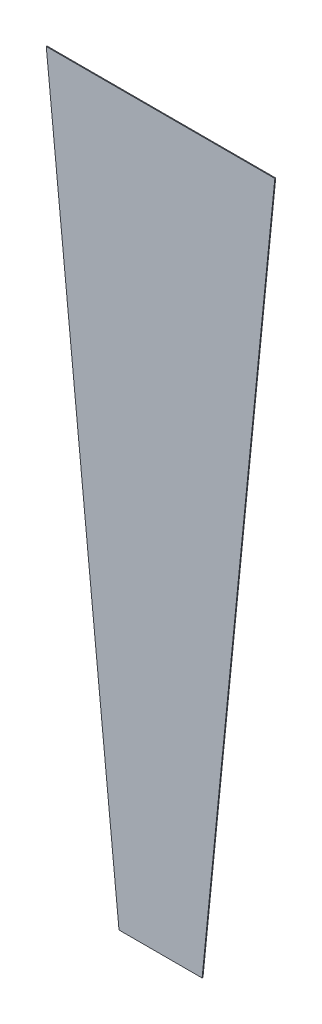
ISO-10303-21;
HEADER;
FILE_DESCRIPTION(('STEP AP214'),'2;1');
FILE_NAME('part.step','',(''),(''),'','','');
FILE_SCHEMA(('AUTOMOTIVE_DESIGN { 1 0 10303 214 1 1 1 1 }'));
ENDSEC;
DATA;
#1=APPLICATION_CONTEXT('core data for automotive mechanical design processes');
#2=APPLICATION_PROTOCOL_DEFINITION('international standard','automotive_design',2000,#1);
#3=PRODUCT_CONTEXT('',#1,'mechanical');
#4=PRODUCT('Part','Part','',(#3));
#5=PRODUCT_RELATED_PRODUCT_CATEGORY('part','',(#4));
#6=PRODUCT_DEFINITION_FORMATION('','',#4);
#7=PRODUCT_DEFINITION_CONTEXT('part definition',#1,'design');
#8=PRODUCT_DEFINITION('design','',#6,#7);
#9=PRODUCT_DEFINITION_SHAPE('','',#8);
#10=(LENGTH_UNIT() NAMED_UNIT(*) SI_UNIT(.MILLI.,.METRE.));
#11=(NAMED_UNIT(*) PLANE_ANGLE_UNIT() SI_UNIT($,.RADIAN.));
#12=(NAMED_UNIT(*) SI_UNIT($,.STERADIAN.) SOLID_ANGLE_UNIT());
#13=UNCERTAINTY_MEASURE_WITH_UNIT(LENGTH_MEASURE(1.E-05),#10,'distance_accuracy_value','');
#14=(GEOMETRIC_REPRESENTATION_CONTEXT(3) GLOBAL_UNCERTAINTY_ASSIGNED_CONTEXT((#13)) GLOBAL_UNIT_ASSIGNED_CONTEXT((#10,
#11,#12)) REPRESENTATION_CONTEXT('',''));
#15=CARTESIAN_POINT('',(0.,0.,0.));
#16=DIRECTION('',(0.,0.,1.));
#17=DIRECTION('',(1.,0.,0.));
#18=AXIS2_PLACEMENT_3D('',#15,#16,#17);
#19=CARTESIAN_POINT('',(-104.963976,-655.465288,0.635));
#20=DIRECTION('',(0.,0.,1.));
#21=DIRECTION('',(1.,0.,0.));
#22=AXIS2_PLACEMENT_3D('',#19,#20,#21);
#23=PLANE('',#22);
#24=DIRECTION('',(-0.0993248441126649,-0.995055061462427,0.));
#25=VECTOR('',#24,1.);
#26=CARTESIAN_POINT('',(68.8086,-320.8274,0.635));
#27=LINE('',#26,#25);
#28=CARTESIAN_POINT('',(36.6903,-642.5946,0.635));
#29=VERTEX_POINT('',#28);
#30=CARTESIAN_POINT('',(100.9269,0.939800000000036,0.635));
#31=VERTEX_POINT('',#30);
#32=EDGE_CURVE('E87',#29,#31,#27,.F.);
#33=ORIENTED_EDGE('',*,*,#32,.T.);
#34=DIRECTION('',(1.,0.,0.));
#35=VECTOR('',#34,1.);
#36=CARTESIAN_POINT('',(0.,0.9398,0.635));
#37=LINE('',#36,#35);
#38=CARTESIAN_POINT('',(-100.9269,0.939800000000024,0.635));
#39=VERTEX_POINT('',#38);
#40=EDGE_CURVE('E67',#31,#39,#37,.F.);
#41=ORIENTED_EDGE('',*,*,#40,.T.);
#42=DIRECTION('',(-0.0993248441126649,0.995055061462427,0.));
#43=VECTOR('',#42,1.);
#44=CARTESIAN_POINT('',(-68.8086,-320.8274,0.635));
#45=LINE('',#44,#43);
#46=CARTESIAN_POINT('',(-36.6903,-642.5946,0.635));
#47=VERTEX_POINT('',#46);
#48=EDGE_CURVE('E54',#39,#47,#45,.F.);
#49=ORIENTED_EDGE('',*,*,#48,.T.);
#50=DIRECTION('',(-1.,0.,0.));
#51=VECTOR('',#50,1.);
#52=CARTESIAN_POINT('',(0.,-642.5946,0.635));
#53=LINE('',#52,#51);
#54=EDGE_CURVE('E65',#47,#29,#53,.F.);
#55=ORIENTED_EDGE('',*,*,#54,.T.);
#56=EDGE_LOOP('',(#33,#41,#49,#55));
#57=FACE_BOUND('',#56,.T.);
#58=ADVANCED_FACE('F17',(#57),#23,.T.);
#59=CARTESIAN_POINT('',(-102.211632,13.810488,-0.14224));
#60=DIRECTION('',(-0.995055061462427,-0.0993248441126649,0.));
#61=DIRECTION('',(0.0993248441126649,-0.995055061462427,0.));
#62=AXIS2_PLACEMENT_3D('',#59,#60,#61);
#63=PLANE('',#62);
#64=ORIENTED_EDGE('',*,*,#48,.F.);
#65=DIRECTION('',(0.,0.,1.));
#66=VECTOR('',#65,1.);
#67=CARTESIAN_POINT('',(-100.9269,0.9398,0.254));
#68=LINE('',#67,#66);
#69=CARTESIAN_POINT('',(-100.9269,0.939800000000037,-0.127));
#70=VERTEX_POINT('',#69);
#71=EDGE_CURVE('E79',#39,#70,#68,.F.);
#72=ORIENTED_EDGE('',*,*,#71,.T.);
#73=DIRECTION('',(0.0993248441126649,-0.995055061462427,0.));
#74=VECTOR('',#73,1.);
#75=CARTESIAN_POINT('',(-102.211632,13.810488,-0.127));
#76=LINE('',#75,#74);
#77=CARTESIAN_POINT('',(-36.6903,-642.5946,-0.127));
#78=VERTEX_POINT('',#77);
#79=EDGE_CURVE('E21',#70,#78,#76,.T.);
#80=ORIENTED_EDGE('',*,*,#79,.T.);
#81=DIRECTION('',(0.,0.,-1.));
#82=VECTOR('',#81,1.);
#83=CARTESIAN_POINT('',(-36.6903,-642.5946,0.254));
#84=LINE('',#83,#82);
#85=EDGE_CURVE('E68',#78,#47,#84,.F.);
#86=ORIENTED_EDGE('',*,*,#85,.T.);
#87=EDGE_LOOP('',(#64,#72,#80,#86));
#88=FACE_BOUND('',#87,.T.);
#89=ADVANCED_FACE('F76',(#88),#63,.T.);
#90=CARTESIAN_POINT('',(-38.157912,-642.5946,-0.14224));
#91=DIRECTION('',(0.,-1.,0.));
#92=DIRECTION('',(1.,0.,0.));
#93=AXIS2_PLACEMENT_3D('',#90,#91,#92);
#94=PLANE('',#93);
#95=ORIENTED_EDGE('',*,*,#54,.F.);
#96=ORIENTED_EDGE('',*,*,#85,.F.);
#97=DIRECTION('',(1.,0.,0.));
#98=VECTOR('',#97,1.);
#99=CARTESIAN_POINT('',(0.,-642.5946,-0.127));
#100=LINE('',#99,#98);
#101=CARTESIAN_POINT('',(36.6903,-642.5946,-0.127));
#102=VERTEX_POINT('',#101);
#103=EDGE_CURVE('E81',#78,#102,#100,.T.);
#104=ORIENTED_EDGE('',*,*,#103,.T.);
#105=DIRECTION('',(0.,0.,-1.));
#106=VECTOR('',#105,1.);
#107=CARTESIAN_POINT('',(36.6903,-642.5946,0.254));
#108=LINE('',#107,#106);
#109=EDGE_CURVE('E74',#102,#29,#108,.F.);
#110=ORIENTED_EDGE('',*,*,#109,.T.);
#111=EDGE_LOOP('',(#95,#96,#104,#110));
#112=FACE_BOUND('',#111,.T.);
#113=ADVANCED_FACE('F72',(#112),#94,.T.);
#114=CARTESIAN_POINT('',(35.405568,-655.465288,-0.14224));
#115=DIRECTION('',(0.995055061462427,-0.0993248441126649,0.));
#116=DIRECTION('',(0.0993248441126649,0.995055061462427,0.));
#117=AXIS2_PLACEMENT_3D('',#114,#115,#116);
#118=PLANE('',#117);
#119=ORIENTED_EDGE('',*,*,#32,.F.);
#120=ORIENTED_EDGE('',*,*,#109,.F.);
#121=DIRECTION('',(0.0993248441126649,0.995055061462427,0.));
#122=VECTOR('',#121,1.);
#123=CARTESIAN_POINT('',(35.405568,-655.465288,-0.127));
#124=LINE('',#123,#122);
#125=CARTESIAN_POINT('',(100.9269,0.939800000000064,-0.127));
#126=VERTEX_POINT('',#125);
#127=EDGE_CURVE('E27',#102,#126,#124,.T.);
#128=ORIENTED_EDGE('',*,*,#127,.T.);
#129=DIRECTION('',(0.,0.,-1.));
#130=VECTOR('',#129,1.);
#131=CARTESIAN_POINT('',(100.9269,0.9398,0.254));
#132=LINE('',#131,#130);
#133=EDGE_CURVE('E35',#126,#31,#132,.F.);
#134=ORIENTED_EDGE('',*,*,#133,.T.);
#135=EDGE_LOOP('',(#119,#120,#128,#134));
#136=FACE_BOUND('',#135,.T.);
#137=ADVANCED_FACE('F96',(#136),#118,.T.);
#138=CARTESIAN_POINT('',(104.963976,0.9398,-0.14224));
#139=DIRECTION('',(0.,1.,0.));
#140=DIRECTION('',(-1.,0.,0.));
#141=AXIS2_PLACEMENT_3D('',#138,#139,#140);
#142=PLANE('',#141);
#143=ORIENTED_EDGE('',*,*,#40,.F.);
#144=ORIENTED_EDGE('',*,*,#133,.F.);
#145=DIRECTION('',(-1.,0.,0.));
#146=VECTOR('',#145,1.);
#147=CARTESIAN_POINT('',(0.,0.93980000000005,-0.127));
#148=LINE('',#147,#146);
#149=EDGE_CURVE('E11',#126,#70,#148,.T.);
#150=ORIENTED_EDGE('',*,*,#149,.T.);
#151=ORIENTED_EDGE('',*,*,#71,.F.);
#152=EDGE_LOOP('',(#143,#144,#150,#151));
#153=FACE_BOUND('',#152,.T.);
#154=ADVANCED_FACE('F90',(#153),#142,.T.);
#155=CARTESIAN_POINT('',(-104.963976,-655.465288,-0.127));
#156=DIRECTION('',(0.,0.,1.));
#157=DIRECTION('',(1.,0.,0.));
#158=AXIS2_PLACEMENT_3D('',#155,#156,#157);
#159=PLANE('',#158);
#160=ORIENTED_EDGE('',*,*,#127,.F.);
#161=ORIENTED_EDGE('',*,*,#103,.F.);
#162=ORIENTED_EDGE('',*,*,#79,.F.);
#163=ORIENTED_EDGE('',*,*,#149,.F.);
#164=EDGE_LOOP('',(#160,#161,#162,#163));
#165=FACE_BOUND('',#164,.T.);
#166=ADVANCED_FACE('F19',(#165),#159,.F.);
#167=CLOSED_SHELL('',(#58,#89,#113,#137,#154,#166));
#168=MANIFOLD_SOLID_BREP('B1',#167);
#169=ADVANCED_BREP_SHAPE_REPRESENTATION('',(#18,#168),#14);
#170=SHAPE_DEFINITION_REPRESENTATION(#9,#169);
ENDSEC;
END-ISO-10303-21;
